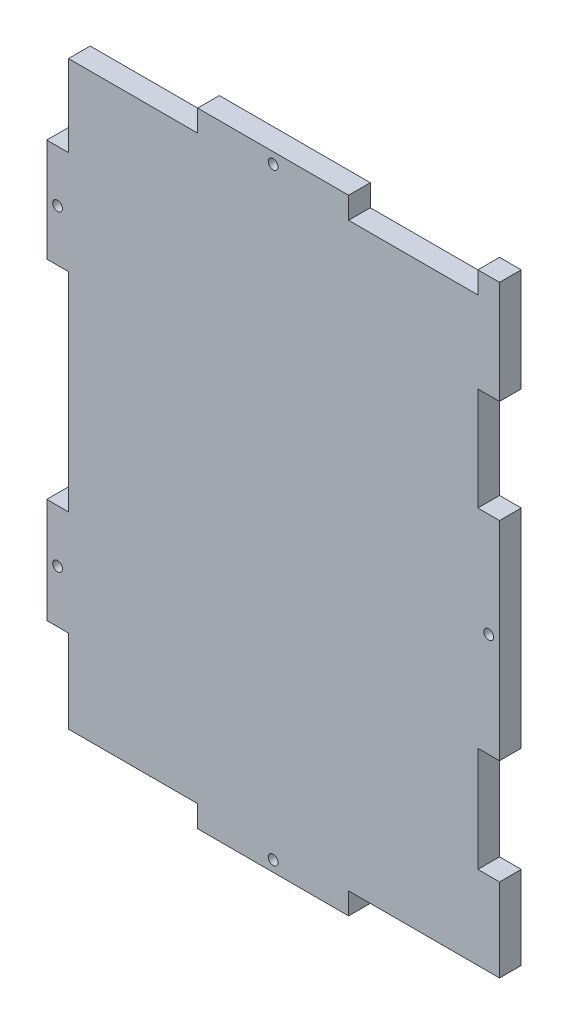
ISO-10303-21;
HEADER;
FILE_DESCRIPTION(('STEP AP214'),'2;1');
FILE_NAME('part.step','',(''),(''),'','','');
FILE_SCHEMA(('AUTOMOTIVE_DESIGN { 1 0 10303 214 1 1 1 1 }'));
ENDSEC;
DATA;
#1=APPLICATION_CONTEXT('core data for automotive mechanical design processes');
#2=APPLICATION_PROTOCOL_DEFINITION('international standard','automotive_design',2000,#1);
#3=PRODUCT_CONTEXT('',#1,'mechanical');
#4=PRODUCT('Part','Part','',(#3));
#5=PRODUCT_RELATED_PRODUCT_CATEGORY('part','',(#4));
#6=PRODUCT_DEFINITION_FORMATION('','',#4);
#7=PRODUCT_DEFINITION_CONTEXT('part definition',#1,'design');
#8=PRODUCT_DEFINITION('design','',#6,#7);
#9=PRODUCT_DEFINITION_SHAPE('','',#8);
#10=(LENGTH_UNIT() NAMED_UNIT(*) SI_UNIT(.MILLI.,.METRE.));
#11=(NAMED_UNIT(*) PLANE_ANGLE_UNIT() SI_UNIT($,.RADIAN.));
#12=(NAMED_UNIT(*) SI_UNIT($,.STERADIAN.) SOLID_ANGLE_UNIT());
#13=UNCERTAINTY_MEASURE_WITH_UNIT(LENGTH_MEASURE(1.E-05),#10,'distance_accuracy_value','');
#14=(GEOMETRIC_REPRESENTATION_CONTEXT(3) GLOBAL_UNCERTAINTY_ASSIGNED_CONTEXT((#13)) GLOBAL_UNIT_ASSIGNED_CONTEXT((#10,
#11,#12)) REPRESENTATION_CONTEXT('',''));
#15=CARTESIAN_POINT('',(0.,0.,0.));
#16=DIRECTION('',(0.,0.,1.));
#17=DIRECTION('',(1.,0.,0.));
#18=AXIS2_PLACEMENT_3D('',#15,#16,#17);
#19=CARTESIAN_POINT('',(60.4012,83.2612,5.7912));
#20=DIRECTION('',(-1.,0.,0.));
#21=DIRECTION('',(0.,-1.,0.));
#22=AXIS2_PLACEMENT_3D('',#19,#20,#21);
#23=PLANE('',#22);
#24=DIRECTION('',(0.,0.,-1.));
#25=VECTOR('',#24,1.);
#26=CARTESIAN_POINT('',(60.4011999999979,-77.4700000000006,129.9464));
#27=LINE('',#26,#25);
#28=CARTESIAN_POINT('',(60.4011999999976,-77.4700000000007,5.7912));
#29=VERTEX_POINT('',#28);
#30=CARTESIAN_POINT('',(60.4011999999976,-77.4700000000007,-2.08166817117217E-13));
#31=VERTEX_POINT('',#30);
#32=EDGE_CURVE('E345',#29,#31,#27,.T.);
#33=ORIENTED_EDGE('',*,*,#32,.T.);
#34=DIRECTION('',(0.,1.,0.));
#35=VECTOR('',#34,1.);
#36=CARTESIAN_POINT('',(60.4012,83.2612,0.));
#37=LINE('',#36,#35);
#38=CARTESIAN_POINT('',(60.4012,-55.2704,0.));
#39=VERTEX_POINT('',#38);
#40=EDGE_CURVE('E457',#31,#39,#37,.T.);
#41=ORIENTED_EDGE('',*,*,#40,.T.);
#42=DIRECTION('',(0.,0.,1.));
#43=VECTOR('',#42,1.);
#44=CARTESIAN_POINT('',(60.4012,-55.2704,0.));
#45=LINE('',#44,#43);
#46=CARTESIAN_POINT('',(60.4012,-55.2704,5.7912));
#47=VERTEX_POINT('',#46);
#48=EDGE_CURVE('E424',#39,#47,#45,.T.);
#49=ORIENTED_EDGE('',*,*,#48,.T.);
#50=DIRECTION('',(0.,1.,0.));
#51=VECTOR('',#50,1.);
#52=CARTESIAN_POINT('',(60.4012,83.2612,5.7912));
#53=LINE('',#52,#51);
#54=EDGE_CURVE('E445',#29,#47,#53,.T.);
#55=ORIENTED_EDGE('',*,*,#54,.F.);
#56=EDGE_LOOP('',(#33,#41,#49,#55));
#57=FACE_BOUND('',#56,.T.);
#58=ADVANCED_FACE('F35',(#57),#23,.F.);
#59=CARTESIAN_POINT('',(-60.4012,83.2612,5.7912));
#60=DIRECTION('',(0.,-1.,0.));
#61=DIRECTION('',(0.,0.,-1.));
#62=AXIS2_PLACEMENT_3D('',#59,#60,#61);
#63=PLANE('',#62);
#64=DIRECTION('',(0.,0.,1.));
#65=VECTOR('',#64,1.);
#66=CARTESIAN_POINT('',(54.6099999999999,83.2611999999997,1.11022302462516E-13));
#67=LINE('',#66,#65);
#68=CARTESIAN_POINT('',(54.6099999999999,83.2611999999997,1.11022302462516E-13));
#69=VERTEX_POINT('',#68);
#70=CARTESIAN_POINT('',(54.6099999999999,83.2611999999997,5.7912));
#71=VERTEX_POINT('',#70);
#72=EDGE_CURVE('E564',#69,#71,#67,.T.);
#73=ORIENTED_EDGE('',*,*,#72,.T.);
#74=DIRECTION('',(-1.,0.,0.));
#75=VECTOR('',#74,1.);
#76=CARTESIAN_POINT('',(-60.4012,83.2612,5.7912));
#77=LINE('',#76,#75);
#78=CARTESIAN_POINT('',(60.4012,83.2612,5.7912));
#79=VERTEX_POINT('',#78);
#80=EDGE_CURVE('E450',#79,#71,#77,.T.);
#81=ORIENTED_EDGE('',*,*,#80,.F.);
#82=DIRECTION('',(0.,0.,-1.));
#83=VECTOR('',#82,1.);
#84=CARTESIAN_POINT('',(60.4012,83.2612,5.7912));
#85=LINE('',#84,#83);
#86=CARTESIAN_POINT('',(60.4012,83.2612,0.));
#87=VERTEX_POINT('',#86);
#88=EDGE_CURVE('E11',#79,#87,#85,.T.);
#89=ORIENTED_EDGE('',*,*,#88,.T.);
#90=DIRECTION('',(-1.,0.,0.));
#91=VECTOR('',#90,1.);
#92=CARTESIAN_POINT('',(-60.4012,83.2612,0.));
#93=LINE('',#92,#91);
#94=EDGE_CURVE('E461',#87,#69,#93,.T.);
#95=ORIENTED_EDGE('',*,*,#94,.T.);
#96=EDGE_LOOP('',(#73,#81,#89,#95));
#97=FACE_BOUND('',#96,.T.);
#98=ADVANCED_FACE('F553',(#97),#63,.F.);
#99=DIRECTION('',(0.,0.,-1.));
#100=VECTOR('',#99,1.);
#101=CARTESIAN_POINT('',(20.1337333333332,83.2611999999998,1.87350135405495E-13));
#102=LINE('',#101,#100);
#103=CARTESIAN_POINT('',(20.1337333333332,83.2611999999998,5.79120000000018));
#104=VERTEX_POINT('',#103);
#105=CARTESIAN_POINT('',(20.1337333333332,83.2611999999998,1.87350135405495E-13));
#106=VERTEX_POINT('',#105);
#107=EDGE_CURVE('E254',#104,#106,#102,.T.);
#108=ORIENTED_EDGE('',*,*,#107,.T.);
#109=CARTESIAN_POINT('',(-20.1337333333335,83.2612,0.));
#110=VERTEX_POINT('',#109);
#111=EDGE_CURVE('E459',#106,#110,#93,.T.);
#112=ORIENTED_EDGE('',*,*,#111,.T.);
#113=DIRECTION('',(0.,0.,1.));
#114=VECTOR('',#113,1.);
#115=CARTESIAN_POINT('',(-20.1337333333335,83.2611999999998,3.12250225675825E-13));
#116=LINE('',#115,#114);
#117=CARTESIAN_POINT('',(-20.1337333333335,83.2611999999998,5.79120000000031));
#118=VERTEX_POINT('',#117);
#119=EDGE_CURVE('E61',#110,#118,#116,.T.);
#120=ORIENTED_EDGE('',*,*,#119,.T.);
#121=EDGE_CURVE('E447',#104,#118,#77,.T.);
#122=ORIENTED_EDGE('',*,*,#121,.F.);
#123=EDGE_LOOP('',(#108,#112,#120,#122));
#124=FACE_BOUND('',#123,.T.);
#125=ADVANCED_FACE('F551',(#124),#63,.F.);
#126=CARTESIAN_POINT('',(-60.4012,83.2612,5.7912));
#127=DIRECTION('',(1.,0.,0.));
#128=DIRECTION('',(0.,1.,0.));
#129=AXIS2_PLACEMENT_3D('',#126,#127,#128);
#130=PLANE('',#129);
#131=DIRECTION('',(0.,0.,-1.));
#132=VECTOR('',#131,1.);
#133=CARTESIAN_POINT('',(-60.4012000000002,-55.2704,4.30211422042248E-13));
#134=LINE('',#133,#132);
#135=CARTESIAN_POINT('',(-60.4012000000001,-55.2704,5.79120000000041));
#136=VERTEX_POINT('',#135);
#137=CARTESIAN_POINT('',(-60.4012,-55.2704,0.));
#138=VERTEX_POINT('',#137);
#139=EDGE_CURVE('E297',#136,#138,#134,.T.);
#140=ORIENTED_EDGE('',*,*,#139,.F.);
#141=DIRECTION('',(0.,-1.,0.));
#142=VECTOR('',#141,1.);
#143=CARTESIAN_POINT('',(-60.4012,83.2612,5.7912));
#144=LINE('',#143,#142);
#145=CARTESIAN_POINT('',(-60.4012000000001,-27.2796,5.79120000000041));
#146=VERTEX_POINT('',#145);
#147=EDGE_CURVE('E453',#146,#136,#144,.T.);
#148=ORIENTED_EDGE('',*,*,#147,.F.);
#149=DIRECTION('',(0.,0.,1.));
#150=VECTOR('',#149,1.);
#151=CARTESIAN_POINT('',(-60.4012000000001,-27.2796,4.16333634234434E-13));
#152=LINE('',#151,#150);
#153=CARTESIAN_POINT('',(-60.4012000000001,-27.2796,4.16333634234434E-13));
#154=VERTEX_POINT('',#153);
#155=EDGE_CURVE('E295',#154,#146,#152,.T.);
#156=ORIENTED_EDGE('',*,*,#155,.F.);
#157=DIRECTION('',(0.,-1.,0.));
#158=VECTOR('',#157,1.);
#159=CARTESIAN_POINT('',(-60.4012,83.2612,0.));
#160=LINE('',#159,#158);
#161=EDGE_CURVE('E464',#154,#138,#160,.T.);
#162=ORIENTED_EDGE('',*,*,#161,.T.);
#163=EDGE_LOOP('',(#140,#148,#156,#162));
#164=FACE_BOUND('',#163,.T.);
#165=ADVANCED_FACE('F549',(#164),#130,.F.);
#166=DIRECTION('',(0.,0.,-1.));
#167=VECTOR('',#166,1.);
#168=CARTESIAN_POINT('',(-60.4012,28.2278666666667,4.30211422042248E-13));
#169=LINE('',#168,#167);
#170=CARTESIAN_POINT('',(-60.4012,28.2278666666667,5.79120000000042));
#171=VERTEX_POINT('',#170);
#172=CARTESIAN_POINT('',(-60.4012,28.2278666666667,0.));
#173=VERTEX_POINT('',#172);
#174=EDGE_CURVE('E278',#171,#173,#169,.T.);
#175=ORIENTED_EDGE('',*,*,#174,.F.);
#176=CARTESIAN_POINT('',(-60.4011999999999,55.7445333333333,5.79120000000043));
#177=VERTEX_POINT('',#176);
#178=EDGE_CURVE('E455',#177,#171,#144,.T.);
#179=ORIENTED_EDGE('',*,*,#178,.F.);
#180=DIRECTION('',(0.,0.,1.));
#181=VECTOR('',#180,1.);
#182=CARTESIAN_POINT('',(-60.4011999999999,55.7445333333333,4.30211422042248E-13));
#183=LINE('',#182,#181);
#184=CARTESIAN_POINT('',(-60.4011999999999,55.7445333333333,4.30211422042248E-13));
#185=VERTEX_POINT('',#184);
#186=EDGE_CURVE('E276',#185,#177,#183,.T.);
#187=ORIENTED_EDGE('',*,*,#186,.F.);
#188=EDGE_CURVE('E467',#185,#173,#160,.T.);
#189=ORIENTED_EDGE('',*,*,#188,.T.);
#190=EDGE_LOOP('',(#175,#179,#187,#189));
#191=FACE_BOUND('',#190,.T.);
#192=ADVANCED_FACE('F547',(#191),#130,.F.);
#193=CARTESIAN_POINT('',(-60.4012,-83.2612,5.7912));
#194=DIRECTION('',(0.,1.,0.));
#195=DIRECTION('',(0.,0.,1.));
#196=AXIS2_PLACEMENT_3D('',#193,#194,#195);
#197=PLANE('',#196);
#198=DIRECTION('',(0.,0.,-1.));
#199=VECTOR('',#198,1.);
#200=CARTESIAN_POINT('',(-20.1337333333357,-83.2612000000009,0.));
#201=LINE('',#200,#199);
#202=CARTESIAN_POINT('',(-20.1337333333357,-83.2612000000009,5.79119999999998));
#203=VERTEX_POINT('',#202);
#204=CARTESIAN_POINT('',(-20.1337333333357,-83.2612000000009,0.));
#205=VERTEX_POINT('',#204);
#206=EDGE_CURVE('E325',#203,#205,#201,.T.);
#207=ORIENTED_EDGE('',*,*,#206,.T.);
#208=DIRECTION('',(1.,0.,0.));
#209=VECTOR('',#208,1.);
#210=CARTESIAN_POINT('',(-60.4012,-83.2612,0.));
#211=LINE('',#210,#209);
#212=CARTESIAN_POINT('',(20.1337333333309,-83.2612,0.));
#213=VERTEX_POINT('',#212);
#214=EDGE_CURVE('E468',#205,#213,#211,.T.);
#215=ORIENTED_EDGE('',*,*,#214,.T.);
#216=DIRECTION('',(0.,0.,1.));
#217=VECTOR('',#216,1.);
#218=CARTESIAN_POINT('',(20.1337333333309,-83.2612000000008,0.));
#219=LINE('',#218,#217);
#220=CARTESIAN_POINT('',(20.1337333333309,-83.2612000000008,5.79119999999989));
#221=VERTEX_POINT('',#220);
#222=EDGE_CURVE('E320',#213,#221,#219,.T.);
#223=ORIENTED_EDGE('',*,*,#222,.T.);
#224=DIRECTION('',(1.,0.,0.));
#225=VECTOR('',#224,1.);
#226=CARTESIAN_POINT('',(-60.4012,-83.2612,5.7912));
#227=LINE('',#226,#225);
#228=EDGE_CURVE('E45',#203,#221,#227,.T.);
#229=ORIENTED_EDGE('',*,*,#228,.F.);
#230=EDGE_LOOP('',(#207,#215,#223,#229));
#231=FACE_BOUND('',#230,.T.);
#232=ADVANCED_FACE('F532',(#231),#197,.F.);
#233=CARTESIAN_POINT('',(0.,0.,5.7912));
#234=DIRECTION('',(0.,0.,1.));
#235=DIRECTION('',(1.,0.,0.));
#236=AXIS2_PLACEMENT_3D('',#233,#234,#235);
#237=PLANE('',#236);
#238=DIRECTION('',(0.,-1.,0.));
#239=VECTOR('',#238,1.);
#240=CARTESIAN_POINT('',(20.1337333333309,-77.4700000000008,5.79119999999989));
#241=LINE('',#240,#239);
#242=CARTESIAN_POINT('',(20.1337333333309,-77.4700000000008,5.79119999999989));
#243=VERTEX_POINT('',#242);
#244=EDGE_CURVE('E338',#243,#221,#241,.T.);
#245=ORIENTED_EDGE('',*,*,#244,.F.);
#246=DIRECTION('',(1.,0.,0.));
#247=VECTOR('',#246,1.);
#248=CARTESIAN_POINT('',(2.28998903173408E-13,-77.4700000000008,5.7912));
#249=LINE('',#248,#247);
#250=EDGE_CURVE('E358',#243,#29,#249,.T.);
#251=ORIENTED_EDGE('',*,*,#250,.T.);
#252=ORIENTED_EDGE('',*,*,#54,.T.);
#253=DIRECTION('',(1.,0.,0.));
#254=VECTOR('',#253,1.);
#255=CARTESIAN_POINT('',(60.4012,-55.2704,5.7912));
#256=LINE('',#255,#254);
#257=CARTESIAN_POINT('',(54.61,-55.2704,5.7912));
#258=VERTEX_POINT('',#257);
#259=EDGE_CURVE('E410',#258,#47,#256,.T.);
#260=ORIENTED_EDGE('',*,*,#259,.F.);
#261=DIRECTION('',(0.,-1.,0.));
#262=VECTOR('',#261,1.);
#263=CARTESIAN_POINT('',(54.61,-27.2796,5.7912));
#264=LINE('',#263,#262);
#265=CARTESIAN_POINT('',(54.61,-27.2796,5.7912));
#266=VERTEX_POINT('',#265);
#267=EDGE_CURVE('E419',#266,#258,#264,.T.);
#268=ORIENTED_EDGE('',*,*,#267,.F.);
#269=DIRECTION('',(-1.,0.,0.));
#270=VECTOR('',#269,1.);
#271=CARTESIAN_POINT('',(60.4012,-27.2796,5.7912));
#272=LINE('',#271,#270);
#273=CARTESIAN_POINT('',(60.4012,-27.2796,5.7912));
#274=VERTEX_POINT('',#273);
#275=EDGE_CURVE('E400',#274,#266,#272,.T.);
#276=ORIENTED_EDGE('',*,*,#275,.F.);
#277=CARTESIAN_POINT('',(60.4012,28.2278666666667,5.7912));
#278=VERTEX_POINT('',#277);
#279=EDGE_CURVE('E448',#274,#278,#53,.T.);
#280=ORIENTED_EDGE('',*,*,#279,.T.);
#281=DIRECTION('',(1.,0.,0.));
#282=VECTOR('',#281,1.);
#283=CARTESIAN_POINT('',(60.4012,28.2278666666667,5.7912));
#284=LINE('',#283,#282);
#285=CARTESIAN_POINT('',(54.61,28.2278666666667,5.7912));
#286=VERTEX_POINT('',#285);
#287=EDGE_CURVE('E384',#286,#278,#284,.T.);
#288=ORIENTED_EDGE('',*,*,#287,.F.);
#289=DIRECTION('',(0.,-1.,0.));
#290=VECTOR('',#289,1.);
#291=CARTESIAN_POINT('',(54.61,55.7445333333333,5.7912));
#292=LINE('',#291,#290);
#293=CARTESIAN_POINT('',(54.61,55.7445333333333,5.7912));
#294=VERTEX_POINT('',#293);
#295=EDGE_CURVE('E393',#294,#286,#292,.T.);
#296=ORIENTED_EDGE('',*,*,#295,.F.);
#297=DIRECTION('',(-1.,0.,0.));
#298=VECTOR('',#297,1.);
#299=CARTESIAN_POINT('',(60.4012,55.7445333333333,5.7912));
#300=LINE('',#299,#298);
#301=CARTESIAN_POINT('',(60.4012,55.7445333333333,5.7912));
#302=VERTEX_POINT('',#301);
#303=EDGE_CURVE('E377',#302,#294,#300,.T.);
#304=ORIENTED_EDGE('',*,*,#303,.F.);
#305=EDGE_CURVE('E449',#302,#79,#53,.T.);
#306=ORIENTED_EDGE('',*,*,#305,.T.);
#307=ORIENTED_EDGE('',*,*,#80,.T.);
#308=DIRECTION('',(0.,-1.,0.));
#309=VECTOR('',#308,1.);
#310=CARTESIAN_POINT('',(54.6099999999997,-1.12732566337481E-13,5.7912));
#311=LINE('',#310,#309);
#312=CARTESIAN_POINT('',(54.6099999999999,77.4699999999996,5.7912));
#313=VERTEX_POINT('',#312);
#314=EDGE_CURVE('E348',#71,#313,#311,.T.);
#315=ORIENTED_EDGE('',*,*,#314,.T.);
#316=DIRECTION('',(-1.,0.,0.));
#317=VECTOR('',#316,1.);
#318=CARTESIAN_POINT('',(1.69330174881743E-13,77.4699999999998,5.7912));
#319=LINE('',#318,#317);
#320=CARTESIAN_POINT('',(20.1337333333332,77.4699999999997,5.79120000000018));
#321=VERTEX_POINT('',#320);
#322=EDGE_CURVE('E352',#313,#321,#319,.T.);
#323=ORIENTED_EDGE('',*,*,#322,.T.);
#324=DIRECTION('',(0.,1.,0.));
#325=VECTOR('',#324,1.);
#326=CARTESIAN_POINT('',(20.1337333333332,77.4699999999997,5.79120000000018));
#327=LINE('',#326,#325);
#328=EDGE_CURVE('E597',#321,#104,#327,.T.);
#329=ORIENTED_EDGE('',*,*,#328,.T.);
#330=ORIENTED_EDGE('',*,*,#121,.T.);
#331=DIRECTION('',(0.,1.,0.));
#332=VECTOR('',#331,1.);
#333=CARTESIAN_POINT('',(-20.1337333333335,77.4699999999998,5.79120000000031));
#334=LINE('',#333,#332);
#335=CARTESIAN_POINT('',(-20.1337333333335,77.4699999999998,5.79120000000031));
#336=VERTEX_POINT('',#335);
#337=EDGE_CURVE('E261',#336,#118,#334,.T.);
#338=ORIENTED_EDGE('',*,*,#337,.F.);
#339=CARTESIAN_POINT('',(-54.6099999999999,77.47,5.7912));
#340=VERTEX_POINT('',#339);
#341=EDGE_CURVE('E251',#336,#340,#319,.T.);
#342=ORIENTED_EDGE('',*,*,#341,.T.);
#343=DIRECTION('',(0.,-1.,0.));
#344=VECTOR('',#343,1.);
#345=CARTESIAN_POINT('',(-54.61,1.01175109956664E-13,5.7912));
#346=LINE('',#345,#344);
#347=CARTESIAN_POINT('',(-54.6099999999999,55.7445333333333,5.79120000000041));
#348=VERTEX_POINT('',#347);
#349=EDGE_CURVE('E357',#340,#348,#346,.T.);
#350=ORIENTED_EDGE('',*,*,#349,.T.);
#351=DIRECTION('',(1.,0.,0.));
#352=VECTOR('',#351,1.);
#353=CARTESIAN_POINT('',(-60.4011999999999,55.7445333333333,5.79120000000043));
#354=LINE('',#353,#352);
#355=EDGE_CURVE('E292',#177,#348,#354,.T.);
#356=ORIENTED_EDGE('',*,*,#355,.F.);
#357=ORIENTED_EDGE('',*,*,#178,.T.);
#358=DIRECTION('',(1.,0.,0.));
#359=VECTOR('',#358,1.);
#360=CARTESIAN_POINT('',(-60.4012,28.2278666666667,5.79120000000042));
#361=LINE('',#360,#359);
#362=CARTESIAN_POINT('',(-54.61,28.2278666666667,5.79120000000041));
#363=VERTEX_POINT('',#362);
#364=EDGE_CURVE('E289',#171,#363,#361,.T.);
#365=ORIENTED_EDGE('',*,*,#364,.T.);
#366=CARTESIAN_POINT('',(-54.6100000000001,-27.2796,5.7912000000004));
#367=VERTEX_POINT('',#366);
#368=EDGE_CURVE('E356',#363,#367,#346,.T.);
#369=ORIENTED_EDGE('',*,*,#368,.T.);
#370=DIRECTION('',(1.,0.,0.));
#371=VECTOR('',#370,1.);
#372=CARTESIAN_POINT('',(-60.4012000000001,-27.2796,5.79120000000041));
#373=LINE('',#372,#371);
#374=EDGE_CURVE('E310',#146,#367,#373,.T.);
#375=ORIENTED_EDGE('',*,*,#374,.F.);
#376=ORIENTED_EDGE('',*,*,#147,.T.);
#377=DIRECTION('',(1.,0.,0.));
#378=VECTOR('',#377,1.);
#379=CARTESIAN_POINT('',(-60.4012000000001,-55.2704,5.79120000000041));
#380=LINE('',#379,#378);
#381=CARTESIAN_POINT('',(-54.6100000000001,-55.2704,5.7912000000004));
#382=VERTEX_POINT('',#381);
#383=EDGE_CURVE('E307',#136,#382,#380,.T.);
#384=ORIENTED_EDGE('',*,*,#383,.T.);
#385=CARTESIAN_POINT('',(-54.6100000000004,-77.470000000001,5.7912));
#386=VERTEX_POINT('',#385);
#387=EDGE_CURVE('E353',#382,#386,#346,.T.);
#388=ORIENTED_EDGE('',*,*,#387,.T.);
#389=CARTESIAN_POINT('',(-20.1337333333357,-77.4700000000009,5.79119999999998));
#390=VERTEX_POINT('',#389);
#391=EDGE_CURVE('E361',#386,#390,#249,.T.);
#392=ORIENTED_EDGE('',*,*,#391,.T.);
#393=DIRECTION('',(0.,-1.,0.));
#394=VECTOR('',#393,1.);
#395=CARTESIAN_POINT('',(-20.1337333333357,-77.4700000000009,5.79119999999998));
#396=LINE('',#395,#394);
#397=EDGE_CURVE('E335',#390,#203,#396,.T.);
#398=ORIENTED_EDGE('',*,*,#397,.T.);
#399=ORIENTED_EDGE('',*,*,#228,.T.);
#400=EDGE_LOOP('',(#245,#251,#252,#260,#268,#276,#280,#288,#296,#304,#306,#307,#315,#323,#329,
#330,#338,#342,#350,#356,#357,#365,#369,#375,#376,#384,#388,#392,#398,#399));
#401=FACE_BOUND('',#400,.T.);
#402=CARTESIAN_POINT('',(0.,-80.3656,5.7912));
#403=DIRECTION('',(0.,0.,1.));
#404=DIRECTION('',(1.,0.,0.));
#405=AXIS2_PLACEMENT_3D('',#402,#403,#404);
#406=CIRCLE('',#405,1.30175);
#407=CARTESIAN_POINT('',(1.30175000000001,-80.3656,5.7912));
#408=VERTEX_POINT('',#407);
#409=EDGE_CURVE('E366',#408,#408,#406,.T.);
#410=ORIENTED_EDGE('',*,*,#409,.F.);
#411=EDGE_LOOP('',(#410));
#412=FACE_BOUND('',#411,.T.);
#413=CARTESIAN_POINT('',(-57.5056,41.9862,5.7912));
#414=DIRECTION('',(0.,0.,1.));
#415=DIRECTION('',(1.,0.,0.));
#416=AXIS2_PLACEMENT_3D('',#413,#414,#415);
#417=CIRCLE('',#416,1.30174999999999);
#418=CARTESIAN_POINT('',(-56.20385,41.9862,5.7912));
#419=VERTEX_POINT('',#418);
#420=EDGE_CURVE('E436',#419,#419,#417,.T.);
#421=ORIENTED_EDGE('',*,*,#420,.F.);
#422=EDGE_LOOP('',(#421));
#423=FACE_BOUND('',#422,.T.);
#424=CARTESIAN_POINT('',(-57.5056,-41.275,5.7912));
#425=DIRECTION('',(0.,0.,1.));
#426=DIRECTION('',(1.,0.,0.));
#427=AXIS2_PLACEMENT_3D('',#424,#425,#426);
#428=CIRCLE('',#427,1.30174999999999);
#429=CARTESIAN_POINT('',(-56.20385,-41.275,5.7912));
#430=VERTEX_POINT('',#429);
#431=EDGE_CURVE('E427',#430,#430,#428,.T.);
#432=ORIENTED_EDGE('',*,*,#431,.F.);
#433=EDGE_LOOP('',(#432));
#434=FACE_BOUND('',#433,.T.);
#435=CARTESIAN_POINT('',(0.,80.3656,5.7912));
#436=DIRECTION('',(0.,0.,1.));
#437=DIRECTION('',(0.998750578124623,-0.0499728195695518,0.));
#438=AXIS2_PLACEMENT_3D('',#435,#436,#437);
#439=CIRCLE('',#438,1.30175000000001);
#440=CARTESIAN_POINT('',(1.30012356507373,80.3005478821253,5.7912));
#441=VERTEX_POINT('',#440);
#442=CARTESIAN_POINT('',(1.30012356507373,80.4306521178747,5.7912));
#443=VERTEX_POINT('',#442);
#444=EDGE_CURVE('E365',#441,#443,#439,.T.);
#445=ORIENTED_EDGE('',*,*,#444,.F.);
#446=CARTESIAN_POINT('',(0.,80.3656,5.7912));
#447=DIRECTION('',(0.,0.,1.));
#448=DIRECTION('',(1.,0.,0.));
#449=AXIS2_PLACEMENT_3D('',#446,#447,#448);
#450=CIRCLE('',#449,1.30175000000001);
#451=EDGE_CURVE('E39',#443,#441,#450,.T.);
#452=ORIENTED_EDGE('',*,*,#451,.F.);
#453=EDGE_LOOP('',(#445,#452));
#454=FACE_BOUND('',#453,.T.);
#455=CARTESIAN_POINT('',(57.5056,0.474133333333345,5.7912));
#456=DIRECTION('',(0.,0.,1.));
#457=DIRECTION('',(1.,0.,0.));
#458=AXIS2_PLACEMENT_3D('',#455,#456,#457);
#459=CIRCLE('',#458,1.30174999999999);
#460=CARTESIAN_POINT('',(58.80735,0.474133333333345,5.7912));
#461=VERTEX_POINT('',#460);
#462=EDGE_CURVE('E371',#461,#461,#459,.T.);
#463=ORIENTED_EDGE('',*,*,#462,.F.);
#464=EDGE_LOOP('',(#463));
#465=FACE_BOUND('',#464,.T.);
#466=ADVANCED_FACE('F528',(#401,#412,#423,#434,#454,#465),#237,.T.);
#467=CARTESIAN_POINT('',(0.,0.,0.));
#468=DIRECTION('',(0.,0.,1.));
#469=DIRECTION('',(1.,0.,0.));
#470=AXIS2_PLACEMENT_3D('',#467,#468,#469);
#471=PLANE('',#470);
#472=CARTESIAN_POINT('',(-57.5056,41.9862,0.));
#473=DIRECTION('',(0.,0.,1.));
#474=DIRECTION('',(1.,0.,0.));
#475=AXIS2_PLACEMENT_3D('',#472,#473,#474);
#476=CIRCLE('',#475,1.30174999999999);
#477=CARTESIAN_POINT('',(-56.20385,41.9862,0.));
#478=VERTEX_POINT('',#477);
#479=EDGE_CURVE('E439',#478,#478,#476,.T.);
#480=ORIENTED_EDGE('',*,*,#479,.T.);
#481=EDGE_LOOP('',(#480));
#482=FACE_BOUND('',#481,.T.);
#483=CARTESIAN_POINT('',(-57.5056,-41.275,0.));
#484=DIRECTION('',(0.,0.,1.));
#485=DIRECTION('',(1.,0.,0.));
#486=AXIS2_PLACEMENT_3D('',#483,#484,#485);
#487=CIRCLE('',#486,1.30174999999999);
#488=CARTESIAN_POINT('',(-56.20385,-41.275,0.));
#489=VERTEX_POINT('',#488);
#490=EDGE_CURVE('E433',#489,#489,#487,.T.);
#491=ORIENTED_EDGE('',*,*,#490,.T.);
#492=EDGE_LOOP('',(#491));
#493=FACE_BOUND('',#492,.T.);
#494=CARTESIAN_POINT('',(57.5056,0.474133333333345,0.));
#495=DIRECTION('',(0.,0.,1.));
#496=DIRECTION('',(1.,0.,0.));
#497=AXIS2_PLACEMENT_3D('',#494,#495,#496);
#498=CIRCLE('',#497,1.30174999999999);
#499=CARTESIAN_POINT('',(58.80735,0.474133333333345,0.));
#500=VERTEX_POINT('',#499);
#501=EDGE_CURVE('E374',#500,#500,#498,.T.);
#502=ORIENTED_EDGE('',*,*,#501,.T.);
#503=EDGE_LOOP('',(#502));
#504=FACE_BOUND('',#503,.T.);
#505=CARTESIAN_POINT('',(0.,80.3656,0.));
#506=DIRECTION('',(0.,0.,1.));
#507=DIRECTION('',(1.,0.,0.));
#508=AXIS2_PLACEMENT_3D('',#505,#506,#507);
#509=CIRCLE('',#508,1.30175000000001);
#510=CARTESIAN_POINT('',(1.30175000000001,80.3656,0.));
#511=VERTEX_POINT('',#510);
#512=EDGE_CURVE('E369',#511,#511,#509,.T.);
#513=ORIENTED_EDGE('',*,*,#512,.T.);
#514=EDGE_LOOP('',(#513));
#515=FACE_BOUND('',#514,.T.);
#516=CARTESIAN_POINT('',(0.,-80.3656,0.));
#517=DIRECTION('',(0.,0.,1.));
#518=DIRECTION('',(1.,0.,0.));
#519=AXIS2_PLACEMENT_3D('',#516,#517,#518);
#520=CIRCLE('',#519,1.30175);
#521=CARTESIAN_POINT('',(1.30175000000001,-80.3656,0.));
#522=VERTEX_POINT('',#521);
#523=EDGE_CURVE('E362',#522,#522,#520,.T.);
#524=ORIENTED_EDGE('',*,*,#523,.T.);
#525=EDGE_LOOP('',(#524));
#526=FACE_BOUND('',#525,.T.);
#527=DIRECTION('',(-1.,0.,0.));
#528=VECTOR('',#527,1.);
#529=CARTESIAN_POINT('',(60.4011999999976,-77.4700000000007,-2.08166817117217E-13));
#530=LINE('',#529,#528);
#531=CARTESIAN_POINT('',(20.1337333333309,-77.4700000000008,0.));
#532=VERTEX_POINT('',#531);
#533=EDGE_CURVE('E343',#31,#532,#530,.T.);
#534=ORIENTED_EDGE('',*,*,#533,.T.);
#535=DIRECTION('',(0.,-1.,0.));
#536=VECTOR('',#535,1.);
#537=CARTESIAN_POINT('',(20.1337333333309,-77.4700000000008,0.));
#538=LINE('',#537,#536);
#539=EDGE_CURVE('E327',#532,#213,#538,.T.);
#540=ORIENTED_EDGE('',*,*,#539,.T.);
#541=ORIENTED_EDGE('',*,*,#214,.F.);
#542=DIRECTION('',(0.,-1.,0.));
#543=VECTOR('',#542,1.);
#544=CARTESIAN_POINT('',(-20.1337333333358,-77.4700000000009,0.));
#545=LINE('',#544,#543);
#546=CARTESIAN_POINT('',(-20.1337333333358,-77.4700000000009,0.));
#547=VERTEX_POINT('',#546);
#548=EDGE_CURVE('E332',#547,#205,#545,.T.);
#549=ORIENTED_EDGE('',*,*,#548,.F.);
#550=CARTESIAN_POINT('',(-54.6100000000004,-77.470000000001,-1.33226762955019E-12));
#551=VERTEX_POINT('',#550);
#552=EDGE_CURVE('E334',#547,#551,#530,.T.);
#553=ORIENTED_EDGE('',*,*,#552,.T.);
#554=DIRECTION('',(0.,1.,0.));
#555=VECTOR('',#554,1.);
#556=CARTESIAN_POINT('',(-54.6100000000002,-83.2612,4.44089209850063E-13));
#557=LINE('',#556,#555);
#558=CARTESIAN_POINT('',(-54.6100000000001,-55.2704,4.16333634234434E-13));
#559=VERTEX_POINT('',#558);
#560=EDGE_CURVE('E314',#551,#559,#557,.T.);
#561=ORIENTED_EDGE('',*,*,#560,.T.);
#562=DIRECTION('',(1.,0.,0.));
#563=VECTOR('',#562,1.);
#564=CARTESIAN_POINT('',(-60.4012000000002,-55.2704,4.30211422042248E-13));
#565=LINE('',#564,#563);
#566=EDGE_CURVE('E304',#138,#559,#565,.T.);
#567=ORIENTED_EDGE('',*,*,#566,.F.);
#568=ORIENTED_EDGE('',*,*,#161,.F.);
#569=DIRECTION('',(1.,0.,0.));
#570=VECTOR('',#569,1.);
#571=CARTESIAN_POINT('',(-60.4012000000001,-27.2796,4.16333634234434E-13));
#572=LINE('',#571,#570);
#573=CARTESIAN_POINT('',(-54.6100000000001,-27.2796,4.02455846426619E-13));
#574=VERTEX_POINT('',#573);
#575=EDGE_CURVE('E300',#154,#574,#572,.T.);
#576=ORIENTED_EDGE('',*,*,#575,.T.);
#577=CARTESIAN_POINT('',(-54.61,28.2278666666667,4.16333634234434E-13));
#578=VERTEX_POINT('',#577);
#579=EDGE_CURVE('E318',#574,#578,#557,.T.);
#580=ORIENTED_EDGE('',*,*,#579,.T.);
#581=DIRECTION('',(1.,0.,0.));
#582=VECTOR('',#581,1.);
#583=CARTESIAN_POINT('',(-60.4012,28.2278666666667,4.30211422042248E-13));
#584=LINE('',#583,#582);
#585=EDGE_CURVE('E285',#173,#578,#584,.T.);
#586=ORIENTED_EDGE('',*,*,#585,.F.);
#587=ORIENTED_EDGE('',*,*,#188,.F.);
#588=DIRECTION('',(1.,0.,0.));
#589=VECTOR('',#588,1.);
#590=CARTESIAN_POINT('',(-60.4011999999999,55.7445333333333,4.30211422042248E-13));
#591=LINE('',#590,#589);
#592=CARTESIAN_POINT('',(-54.6099999999999,55.7445333333333,4.16333634234434E-13));
#593=VERTEX_POINT('',#592);
#594=EDGE_CURVE('E281',#185,#593,#591,.T.);
#595=ORIENTED_EDGE('',*,*,#594,.T.);
#596=CARTESIAN_POINT('',(-54.6099999999999,77.4699999999999,4.61933957751626E-13));
#597=VERTEX_POINT('',#596);
#598=EDGE_CURVE('E267',#593,#597,#557,.T.);
#599=ORIENTED_EDGE('',*,*,#598,.T.);
#600=DIRECTION('',(1.,0.,0.));
#601=VECTOR('',#600,1.);
#602=CARTESIAN_POINT('',(-60.4012000000002,77.4699999999999,4.57966997657877E-13));
#603=LINE('',#602,#601);
#604=CARTESIAN_POINT('',(-20.1337333333335,77.4699999999998,3.12250225675825E-13));
#605=VERTEX_POINT('',#604);
#606=EDGE_CURVE('E248',#597,#605,#603,.T.);
#607=ORIENTED_EDGE('',*,*,#606,.T.);
#608=DIRECTION('',(0.,1.,0.));
#609=VECTOR('',#608,1.);
#610=CARTESIAN_POINT('',(-20.1337333333335,77.4699999999998,3.12250225675825E-13));
#611=LINE('',#610,#609);
#612=EDGE_CURVE('E256',#605,#110,#611,.T.);
#613=ORIENTED_EDGE('',*,*,#612,.T.);
#614=ORIENTED_EDGE('',*,*,#111,.F.);
#615=DIRECTION('',(0.,1.,0.));
#616=VECTOR('',#615,1.);
#617=CARTESIAN_POINT('',(20.1337333333332,77.4699999999997,1.87350135405495E-13));
#618=LINE('',#617,#616);
#619=CARTESIAN_POINT('',(20.1337333333332,77.4699999999997,0.));
#620=VERTEX_POINT('',#619);
#621=EDGE_CURVE('E571',#620,#106,#618,.T.);
#622=ORIENTED_EDGE('',*,*,#621,.F.);
#623=CARTESIAN_POINT('',(54.6099999999999,77.4699999999996,1.11022302462516E-13));
#624=VERTEX_POINT('',#623);
#625=EDGE_CURVE('E53',#620,#624,#603,.T.);
#626=ORIENTED_EDGE('',*,*,#625,.T.);
#627=DIRECTION('',(0.,1.,0.));
#628=VECTOR('',#627,1.);
#629=CARTESIAN_POINT('',(54.6099999999999,77.4699999999996,1.11022302462516E-13));
#630=LINE('',#629,#628);
#631=EDGE_CURVE('E272',#624,#69,#630,.T.);
#632=ORIENTED_EDGE('',*,*,#631,.T.);
#633=ORIENTED_EDGE('',*,*,#94,.F.);
#634=CARTESIAN_POINT('',(60.4012,55.7445333333333,0.));
#635=VERTEX_POINT('',#634);
#636=EDGE_CURVE('E442',#635,#87,#37,.T.);
#637=ORIENTED_EDGE('',*,*,#636,.F.);
#638=DIRECTION('',(-1.,0.,0.));
#639=VECTOR('',#638,1.);
#640=CARTESIAN_POINT('',(60.4012,55.7445333333333,0.));
#641=LINE('',#640,#639);
#642=CARTESIAN_POINT('',(54.61,55.7445333333333,0.));
#643=VERTEX_POINT('',#642);
#644=EDGE_CURVE('E380',#635,#643,#641,.T.);
#645=ORIENTED_EDGE('',*,*,#644,.T.);
#646=DIRECTION('',(0.,-1.,0.));
#647=VECTOR('',#646,1.);
#648=CARTESIAN_POINT('',(54.61,55.7445333333333,0.));
#649=LINE('',#648,#647);
#650=CARTESIAN_POINT('',(54.61,28.2278666666667,0.));
#651=VERTEX_POINT('',#650);
#652=EDGE_CURVE('E383',#643,#651,#649,.T.);
#653=ORIENTED_EDGE('',*,*,#652,.T.);
#654=DIRECTION('',(1.,0.,0.));
#655=VECTOR('',#654,1.);
#656=CARTESIAN_POINT('',(60.4012,28.2278666666667,0.));
#657=LINE('',#656,#655);
#658=CARTESIAN_POINT('',(60.4012,28.2278666666667,0.));
#659=VERTEX_POINT('',#658);
#660=EDGE_CURVE('E387',#651,#659,#657,.T.);
#661=ORIENTED_EDGE('',*,*,#660,.T.);
#662=CARTESIAN_POINT('',(60.4012,-27.2796,0.));
#663=VERTEX_POINT('',#662);
#664=EDGE_CURVE('E460',#663,#659,#37,.T.);
#665=ORIENTED_EDGE('',*,*,#664,.F.);
#666=DIRECTION('',(-1.,0.,0.));
#667=VECTOR('',#666,1.);
#668=CARTESIAN_POINT('',(60.4012,-27.2796,0.));
#669=LINE('',#668,#667);
#670=CARTESIAN_POINT('',(54.61,-27.2796,0.));
#671=VERTEX_POINT('',#670);
#672=EDGE_CURVE('E406',#663,#671,#669,.T.);
#673=ORIENTED_EDGE('',*,*,#672,.T.);
#674=DIRECTION('',(0.,-1.,0.));
#675=VECTOR('',#674,1.);
#676=CARTESIAN_POINT('',(54.61,-27.2796,0.));
#677=LINE('',#676,#675);
#678=CARTESIAN_POINT('',(54.61,-55.2704,0.));
#679=VERTEX_POINT('',#678);
#680=EDGE_CURVE('E409',#671,#679,#677,.T.);
#681=ORIENTED_EDGE('',*,*,#680,.T.);
#682=DIRECTION('',(1.,0.,0.));
#683=VECTOR('',#682,1.);
#684=CARTESIAN_POINT('',(60.4012,-55.2704,0.));
#685=LINE('',#684,#683);
#686=EDGE_CURVE('E413',#679,#39,#685,.T.);
#687=ORIENTED_EDGE('',*,*,#686,.T.);
#688=ORIENTED_EDGE('',*,*,#40,.F.);
#689=EDGE_LOOP('',(#534,#540,#541,#549,#553,#561,#567,#568,#576,#580,#586,#587,#595,#599,#607,
#613,#614,#622,#626,#632,#633,#637,#645,#653,#661,#665,#673,#681,#687,#688));
#690=FACE_BOUND('',#689,.T.);
#691=ADVANCED_FACE('F264',(#482,#493,#504,#515,#526,#690),#471,.F.);
#692=ORIENTED_EDGE('',*,*,#664,.T.);
#693=DIRECTION('',(0.,0.,1.));
#694=VECTOR('',#693,1.);
#695=CARTESIAN_POINT('',(60.4012,28.2278666666667,0.));
#696=LINE('',#695,#694);
#697=EDGE_CURVE('E397',#659,#278,#696,.T.);
#698=ORIENTED_EDGE('',*,*,#697,.T.);
#699=ORIENTED_EDGE('',*,*,#279,.F.);
#700=DIRECTION('',(0.,0.,1.));
#701=VECTOR('',#700,1.);
#702=CARTESIAN_POINT('',(60.4012,-27.2796,0.));
#703=LINE('',#702,#701);
#704=EDGE_CURVE('E416',#663,#274,#703,.T.);
#705=ORIENTED_EDGE('',*,*,#704,.F.);
#706=EDGE_LOOP('',(#692,#698,#699,#705));
#707=FACE_BOUND('',#706,.T.);
#708=ADVANCED_FACE('F543',(#707),#23,.F.);
#709=ORIENTED_EDGE('',*,*,#305,.F.);
#710=DIRECTION('',(0.,0.,1.));
#711=VECTOR('',#710,1.);
#712=CARTESIAN_POINT('',(60.4012,55.7445333333333,0.));
#713=LINE('',#712,#711);
#714=EDGE_CURVE('E390',#635,#302,#713,.T.);
#715=ORIENTED_EDGE('',*,*,#714,.F.);
#716=ORIENTED_EDGE('',*,*,#636,.T.);
#717=ORIENTED_EDGE('',*,*,#88,.F.);
#718=EDGE_LOOP('',(#709,#715,#716,#717));
#719=FACE_BOUND('',#718,.T.);
#720=ADVANCED_FACE('F37',(#719),#23,.F.);
#721=CARTESIAN_POINT('',(-57.5056,41.9862,0.));
#722=DIRECTION('',(0.,0.,1.));
#723=DIRECTION('',(1.,0.,0.));
#724=AXIS2_PLACEMENT_3D('',#721,#722,#723);
#725=CYLINDRICAL_SURFACE('',#724,1.30174999999999);
#726=ORIENTED_EDGE('',*,*,#479,.F.);
#727=EDGE_LOOP('',(#726));
#728=FACE_BOUND('',#727,.T.);
#729=ORIENTED_EDGE('',*,*,#420,.T.);
#730=EDGE_LOOP('',(#729));
#731=FACE_BOUND('',#730,.T.);
#732=ADVANCED_FACE('F523',(#728,#731),#725,.F.);
#733=CARTESIAN_POINT('',(-57.5056,-41.275,0.));
#734=DIRECTION('',(0.,0.,1.));
#735=DIRECTION('',(1.,0.,0.));
#736=AXIS2_PLACEMENT_3D('',#733,#734,#735);
#737=CYLINDRICAL_SURFACE('',#736,1.30174999999999);
#738=ORIENTED_EDGE('',*,*,#490,.F.);
#739=EDGE_LOOP('',(#738));
#740=FACE_BOUND('',#739,.T.);
#741=ORIENTED_EDGE('',*,*,#431,.T.);
#742=EDGE_LOOP('',(#741));
#743=FACE_BOUND('',#742,.T.);
#744=ADVANCED_FACE('F513',(#740,#743),#737,.F.);
#745=CARTESIAN_POINT('',(60.4012,-55.2704,0.));
#746=DIRECTION('',(0.,-1.,0.));
#747=DIRECTION('',(0.,0.,-1.));
#748=AXIS2_PLACEMENT_3D('',#745,#746,#747);
#749=PLANE('',#748);
#750=ORIENTED_EDGE('',*,*,#259,.T.);
#751=ORIENTED_EDGE('',*,*,#48,.F.);
#752=ORIENTED_EDGE('',*,*,#686,.F.);
#753=DIRECTION('',(0.,0.,1.));
#754=VECTOR('',#753,1.);
#755=CARTESIAN_POINT('',(54.61,-55.2704,0.));
#756=LINE('',#755,#754);
#757=EDGE_CURVE('E428',#679,#258,#756,.T.);
#758=ORIENTED_EDGE('',*,*,#757,.T.);
#759=EDGE_LOOP('',(#750,#751,#752,#758));
#760=FACE_BOUND('',#759,.T.);
#761=ADVANCED_FACE('F509',(#760),#749,.F.);
#762=CARTESIAN_POINT('',(54.61,-27.2796,0.));
#763=DIRECTION('',(-1.,0.,0.));
#764=DIRECTION('',(0.,0.,1.));
#765=AXIS2_PLACEMENT_3D('',#762,#763,#764);
#766=PLANE('',#765);
#767=ORIENTED_EDGE('',*,*,#267,.T.);
#768=ORIENTED_EDGE('',*,*,#757,.F.);
#769=ORIENTED_EDGE('',*,*,#680,.F.);
#770=DIRECTION('',(0.,0.,1.));
#771=VECTOR('',#770,1.);
#772=CARTESIAN_POINT('',(54.61,-27.2796,0.));
#773=LINE('',#772,#771);
#774=EDGE_CURVE('E430',#671,#266,#773,.T.);
#775=ORIENTED_EDGE('',*,*,#774,.T.);
#776=EDGE_LOOP('',(#767,#768,#769,#775));
#777=FACE_BOUND('',#776,.T.);
#778=ADVANCED_FACE('F512',(#777),#766,.F.);
#779=CARTESIAN_POINT('',(60.4012,-27.2796,0.));
#780=DIRECTION('',(0.,1.,0.));
#781=DIRECTION('',(0.,0.,1.));
#782=AXIS2_PLACEMENT_3D('',#779,#780,#781);
#783=PLANE('',#782);
#784=ORIENTED_EDGE('',*,*,#275,.T.);
#785=ORIENTED_EDGE('',*,*,#774,.F.);
#786=ORIENTED_EDGE('',*,*,#672,.F.);
#787=ORIENTED_EDGE('',*,*,#704,.T.);
#788=EDGE_LOOP('',(#784,#785,#786,#787));
#789=FACE_BOUND('',#788,.T.);
#790=ADVANCED_FACE('F501',(#789),#783,.F.);
#791=CARTESIAN_POINT('',(60.4012,28.2278666666667,0.));
#792=DIRECTION('',(0.,-1.,0.));
#793=DIRECTION('',(0.,0.,-1.));
#794=AXIS2_PLACEMENT_3D('',#791,#792,#793);
#795=PLANE('',#794);
#796=ORIENTED_EDGE('',*,*,#287,.T.);
#797=ORIENTED_EDGE('',*,*,#697,.F.);
#798=ORIENTED_EDGE('',*,*,#660,.F.);
#799=DIRECTION('',(0.,0.,1.));
#800=VECTOR('',#799,1.);
#801=CARTESIAN_POINT('',(54.61,28.2278666666667,0.));
#802=LINE('',#801,#800);
#803=EDGE_CURVE('E401',#651,#286,#802,.T.);
#804=ORIENTED_EDGE('',*,*,#803,.T.);
#805=EDGE_LOOP('',(#796,#797,#798,#804));
#806=FACE_BOUND('',#805,.T.);
#807=ADVANCED_FACE('F497',(#806),#795,.F.);
#808=CARTESIAN_POINT('',(54.61,55.7445333333333,0.));
#809=DIRECTION('',(-1.,0.,0.));
#810=DIRECTION('',(0.,-1.,0.));
#811=AXIS2_PLACEMENT_3D('',#808,#809,#810);
#812=PLANE('',#811);
#813=ORIENTED_EDGE('',*,*,#295,.T.);
#814=ORIENTED_EDGE('',*,*,#803,.F.);
#815=ORIENTED_EDGE('',*,*,#652,.F.);
#816=DIRECTION('',(0.,0.,1.));
#817=VECTOR('',#816,1.);
#818=CARTESIAN_POINT('',(54.61,55.7445333333333,0.));
#819=LINE('',#818,#817);
#820=EDGE_CURVE('E403',#643,#294,#819,.T.);
#821=ORIENTED_EDGE('',*,*,#820,.T.);
#822=EDGE_LOOP('',(#813,#814,#815,#821));
#823=FACE_BOUND('',#822,.T.);
#824=ADVANCED_FACE('F500',(#823),#812,.F.);
#825=CARTESIAN_POINT('',(60.4012,55.7445333333333,0.));
#826=DIRECTION('',(0.,1.,0.));
#827=DIRECTION('',(-1.,0.,0.));
#828=AXIS2_PLACEMENT_3D('',#825,#826,#827);
#829=PLANE('',#828);
#830=ORIENTED_EDGE('',*,*,#303,.T.);
#831=ORIENTED_EDGE('',*,*,#820,.F.);
#832=ORIENTED_EDGE('',*,*,#644,.F.);
#833=ORIENTED_EDGE('',*,*,#714,.T.);
#834=EDGE_LOOP('',(#830,#831,#832,#833));
#835=FACE_BOUND('',#834,.T.);
#836=ADVANCED_FACE('F495',(#835),#829,.F.);
#837=CARTESIAN_POINT('',(57.5056,0.474133333333345,0.));
#838=DIRECTION('',(0.,0.,1.));
#839=DIRECTION('',(1.,0.,0.));
#840=AXIS2_PLACEMENT_3D('',#837,#838,#839);
#841=CYLINDRICAL_SURFACE('',#840,1.30174999999999);
#842=ORIENTED_EDGE('',*,*,#501,.F.);
#843=EDGE_LOOP('',(#842));
#844=FACE_BOUND('',#843,.T.);
#845=ORIENTED_EDGE('',*,*,#462,.T.);
#846=EDGE_LOOP('',(#845));
#847=FACE_BOUND('',#846,.T.);
#848=ADVANCED_FACE('F490',(#844,#847),#841,.F.);
#849=CARTESIAN_POINT('',(0.,80.3656,0.));
#850=DIRECTION('',(0.,0.,1.));
#851=DIRECTION('',(1.,0.,0.));
#852=AXIS2_PLACEMENT_3D('',#849,#850,#851);
#853=CYLINDRICAL_SURFACE('',#852,1.30175000000001);
#854=ORIENTED_EDGE('',*,*,#512,.F.);
#855=EDGE_LOOP('',(#854));
#856=FACE_BOUND('',#855,.T.);
#857=ORIENTED_EDGE('',*,*,#451,.T.);
#858=ORIENTED_EDGE('',*,*,#444,.T.);
#859=EDGE_LOOP('',(#857,#858));
#860=FACE_BOUND('',#859,.T.);
#861=ADVANCED_FACE('F479',(#856,#860),#853,.F.);
#862=CARTESIAN_POINT('',(0.,-80.3656,0.));
#863=DIRECTION('',(0.,0.,1.));
#864=DIRECTION('',(1.,0.,0.));
#865=AXIS2_PLACEMENT_3D('',#862,#863,#864);
#866=CYLINDRICAL_SURFACE('',#865,1.30175);
#867=ORIENTED_EDGE('',*,*,#523,.F.);
#868=EDGE_LOOP('',(#867));
#869=FACE_BOUND('',#868,.T.);
#870=ORIENTED_EDGE('',*,*,#409,.T.);
#871=EDGE_LOOP('',(#870));
#872=FACE_BOUND('',#871,.T.);
#873=ADVANCED_FACE('F489',(#869,#872),#866,.F.);
#874=CARTESIAN_POINT('',(-60.4011999999999,55.7445333333333,4.30211422042248E-13));
#875=DIRECTION('',(0.,1.,0.));
#876=DIRECTION('',(0.,0.,1.));
#877=AXIS2_PLACEMENT_3D('',#874,#875,#876);
#878=PLANE('',#877);
#879=DIRECTION('',(0.,0.,1.));
#880=VECTOR('',#879,1.);
#881=CARTESIAN_POINT('',(-54.6099999999999,55.7445333333333,4.16333634234434E-13));
#882=LINE('',#881,#880);
#883=EDGE_CURVE('E270',#593,#348,#882,.T.);
#884=ORIENTED_EDGE('',*,*,#883,.F.);
#885=ORIENTED_EDGE('',*,*,#594,.F.);
#886=ORIENTED_EDGE('',*,*,#186,.T.);
#887=ORIENTED_EDGE('',*,*,#355,.T.);
#888=EDGE_LOOP('',(#884,#885,#886,#887));
#889=FACE_BOUND('',#888,.T.);
#890=ADVANCED_FACE('F633',(#889),#878,.T.);
#891=CARTESIAN_POINT('',(-20.1337333333335,77.4699999999998,3.12250225675825E-13));
#892=DIRECTION('',(-1.,0.,0.));
#893=DIRECTION('',(0.,1.,0.));
#894=AXIS2_PLACEMENT_3D('',#891,#892,#893);
#895=PLANE('',#894);
#896=ORIENTED_EDGE('',*,*,#119,.F.);
#897=ORIENTED_EDGE('',*,*,#612,.F.);
#898=DIRECTION('',(0.,0.,1.));
#899=VECTOR('',#898,1.);
#900=CARTESIAN_POINT('',(-20.1337333333335,77.4699999999998,3.12250225675825E-13));
#901=LINE('',#900,#899);
#902=EDGE_CURVE('E244',#605,#336,#901,.T.);
#903=ORIENTED_EDGE('',*,*,#902,.T.);
#904=ORIENTED_EDGE('',*,*,#337,.T.);
#905=EDGE_LOOP('',(#896,#897,#903,#904));
#906=FACE_BOUND('',#905,.T.);
#907=ADVANCED_FACE('F257',(#906),#895,.T.);
#908=CARTESIAN_POINT('',(0.,77.4699999999998,53.0606000000003));
#909=DIRECTION('',(0.,1.,0.));
#910=DIRECTION('',(0.,0.,1.));
#911=AXIS2_PLACEMENT_3D('',#908,#909,#910);
#912=PLANE('',#911);
#913=ORIENTED_EDGE('',*,*,#902,.F.);
#914=ORIENTED_EDGE('',*,*,#606,.F.);
#915=DIRECTION('',(0.,0.,-1.));
#916=VECTOR('',#915,1.);
#917=CARTESIAN_POINT('',(-54.6099999999998,77.47,35.3737333333338));
#918=LINE('',#917,#916);
#919=EDGE_CURVE('E268',#340,#597,#918,.T.);
#920=ORIENTED_EDGE('',*,*,#919,.F.);
#921=ORIENTED_EDGE('',*,*,#341,.F.);
#922=EDGE_LOOP('',(#913,#914,#920,#921));
#923=FACE_BOUND('',#922,.T.);
#924=ADVANCED_FACE('F245',(#923),#912,.T.);
#925=CARTESIAN_POINT('',(-54.61,-41.275,64.9732000000004));
#926=DIRECTION('',(-1.,0.,0.));
#927=DIRECTION('',(0.,0.,1.));
#928=AXIS2_PLACEMENT_3D('',#925,#926,#927);
#929=PLANE('',#928);
#930=ORIENTED_EDGE('',*,*,#919,.T.);
#931=ORIENTED_EDGE('',*,*,#598,.F.);
#932=ORIENTED_EDGE('',*,*,#883,.T.);
#933=ORIENTED_EDGE('',*,*,#349,.F.);
#934=EDGE_LOOP('',(#930,#931,#932,#933));
#935=FACE_BOUND('',#934,.T.);
#936=ADVANCED_FACE('F623',(#935),#929,.T.);
#937=CARTESIAN_POINT('',(20.1337333333332,77.4699999999997,1.87350135405495E-13));
#938=DIRECTION('',(1.,0.,0.));
#939=DIRECTION('',(0.,-1.,0.));
#940=AXIS2_PLACEMENT_3D('',#937,#938,#939);
#941=PLANE('',#940);
#942=ORIENTED_EDGE('',*,*,#107,.F.);
#943=ORIENTED_EDGE('',*,*,#328,.F.);
#944=DIRECTION('',(0.,0.,-1.));
#945=VECTOR('',#944,1.);
#946=CARTESIAN_POINT('',(20.1337333333332,77.4699999999997,1.87350135405495E-13));
#947=LINE('',#946,#945);
#948=EDGE_CURVE('E253',#321,#620,#947,.T.);
#949=ORIENTED_EDGE('',*,*,#948,.T.);
#950=ORIENTED_EDGE('',*,*,#621,.T.);
#951=EDGE_LOOP('',(#942,#943,#949,#950));
#952=FACE_BOUND('',#951,.T.);
#953=ADVANCED_FACE('F605',(#952),#941,.T.);
#954=CARTESIAN_POINT('',(54.6099999999999,77.4699999999996,1.11022302462516E-13));
#955=DIRECTION('',(-1.,0.,0.));
#956=DIRECTION('',(0.,1.,0.));
#957=AXIS2_PLACEMENT_3D('',#954,#955,#956);
#958=PLANE('',#957);
#959=ORIENTED_EDGE('',*,*,#72,.F.);
#960=ORIENTED_EDGE('',*,*,#631,.F.);
#961=DIRECTION('',(0.,0.,1.));
#962=VECTOR('',#961,1.);
#963=CARTESIAN_POINT('',(54.6099999999999,77.4699999999996,1.11022302462516E-13));
#964=LINE('',#963,#962);
#965=EDGE_CURVE('E570',#624,#313,#964,.T.);
#966=ORIENTED_EDGE('',*,*,#965,.T.);
#967=ORIENTED_EDGE('',*,*,#314,.F.);
#968=EDGE_LOOP('',(#959,#960,#966,#967));
#969=FACE_BOUND('',#968,.T.);
#970=ADVANCED_FACE('F610',(#969),#958,.T.);
#971=ORIENTED_EDGE('',*,*,#965,.F.);
#972=ORIENTED_EDGE('',*,*,#625,.F.);
#973=ORIENTED_EDGE('',*,*,#948,.F.);
#974=ORIENTED_EDGE('',*,*,#322,.F.);
#975=EDGE_LOOP('',(#971,#972,#973,#974));
#976=FACE_BOUND('',#975,.T.);
#977=ADVANCED_FACE('F607',(#976),#912,.T.);
#978=CARTESIAN_POINT('',(-60.4012000000001,-27.2796,4.16333634234434E-13));
#979=DIRECTION('',(0.,1.,0.));
#980=DIRECTION('',(1.,0.,0.));
#981=AXIS2_PLACEMENT_3D('',#978,#979,#980);
#982=PLANE('',#981);
#983=DIRECTION('',(0.,0.,1.));
#984=VECTOR('',#983,1.);
#985=CARTESIAN_POINT('',(-54.6100000000001,-27.2796,4.02455846426619E-13));
#986=LINE('',#985,#984);
#987=EDGE_CURVE('E288',#574,#367,#986,.T.);
#988=ORIENTED_EDGE('',*,*,#987,.F.);
#989=ORIENTED_EDGE('',*,*,#575,.F.);
#990=ORIENTED_EDGE('',*,*,#155,.T.);
#991=ORIENTED_EDGE('',*,*,#374,.T.);
#992=EDGE_LOOP('',(#988,#989,#990,#991));
#993=FACE_BOUND('',#992,.T.);
#994=ADVANCED_FACE('F609',(#993),#982,.T.);
#995=CARTESIAN_POINT('',(-60.4012,28.2278666666667,4.30211422042248E-13));
#996=DIRECTION('',(0.,-1.,0.));
#997=DIRECTION('',(0.,0.,-1.));
#998=AXIS2_PLACEMENT_3D('',#995,#996,#997);
#999=PLANE('',#998);
#1000=DIRECTION('',(0.,0.,-1.));
#1001=VECTOR('',#1000,1.);
#1002=CARTESIAN_POINT('',(-54.61,28.2278666666667,4.16333634234434E-13));
#1003=LINE('',#1002,#1001);
#1004=EDGE_CURVE('E279',#363,#578,#1003,.T.);
#1005=ORIENTED_EDGE('',*,*,#1004,.F.);
#1006=ORIENTED_EDGE('',*,*,#364,.F.);
#1007=ORIENTED_EDGE('',*,*,#174,.T.);
#1008=ORIENTED_EDGE('',*,*,#585,.T.);
#1009=EDGE_LOOP('',(#1005,#1006,#1007,#1008));
#1010=FACE_BOUND('',#1009,.T.);
#1011=ADVANCED_FACE('F617',(#1010),#999,.T.);
#1012=ORIENTED_EDGE('',*,*,#1004,.T.);
#1013=ORIENTED_EDGE('',*,*,#579,.F.);
#1014=ORIENTED_EDGE('',*,*,#987,.T.);
#1015=ORIENTED_EDGE('',*,*,#368,.F.);
#1016=EDGE_LOOP('',(#1012,#1013,#1014,#1015));
#1017=FACE_BOUND('',#1016,.T.);
#1018=ADVANCED_FACE('F631',(#1017),#929,.T.);
#1019=CARTESIAN_POINT('',(-20.1337333333358,-77.4700000000009,0.));
#1020=DIRECTION('',(-1.,0.,0.));
#1021=DIRECTION('',(0.,1.,0.));
#1022=AXIS2_PLACEMENT_3D('',#1019,#1020,#1021);
#1023=PLANE('',#1022);
#1024=ORIENTED_EDGE('',*,*,#206,.F.);
#1025=ORIENTED_EDGE('',*,*,#397,.F.);
#1026=DIRECTION('',(0.,0.,-1.));
#1027=VECTOR('',#1026,1.);
#1028=CARTESIAN_POINT('',(-20.1337333333358,-77.4700000000009,0.));
#1029=LINE('',#1028,#1027);
#1030=EDGE_CURVE('E324',#390,#547,#1029,.T.);
#1031=ORIENTED_EDGE('',*,*,#1030,.T.);
#1032=ORIENTED_EDGE('',*,*,#548,.T.);
#1033=EDGE_LOOP('',(#1024,#1025,#1031,#1032));
#1034=FACE_BOUND('',#1033,.T.);
#1035=ADVANCED_FACE('F673',(#1034),#1023,.T.);
#1036=CARTESIAN_POINT('',(-60.4012000000002,-55.2704,4.30211422042248E-13));
#1037=DIRECTION('',(0.,-1.,0.));
#1038=DIRECTION('',(-1.,0.,0.));
#1039=AXIS2_PLACEMENT_3D('',#1036,#1037,#1038);
#1040=PLANE('',#1039);
#1041=DIRECTION('',(0.,0.,-1.));
#1042=VECTOR('',#1041,1.);
#1043=CARTESIAN_POINT('',(-54.6100000000001,-55.2704,4.16333634234434E-13));
#1044=LINE('',#1043,#1042);
#1045=EDGE_CURVE('E298',#382,#559,#1044,.T.);
#1046=ORIENTED_EDGE('',*,*,#1045,.F.);
#1047=ORIENTED_EDGE('',*,*,#383,.F.);
#1048=ORIENTED_EDGE('',*,*,#139,.T.);
#1049=ORIENTED_EDGE('',*,*,#566,.T.);
#1050=EDGE_LOOP('',(#1046,#1047,#1048,#1049));
#1051=FACE_BOUND('',#1050,.T.);
#1052=ADVANCED_FACE('F680',(#1051),#1040,.T.);
#1053=ORIENTED_EDGE('',*,*,#1045,.T.);
#1054=ORIENTED_EDGE('',*,*,#560,.F.);
#1055=DIRECTION('',(0.,0.,-1.));
#1056=VECTOR('',#1055,1.);
#1057=CARTESIAN_POINT('',(-54.6100000000002,-77.470000000001,64.9732));
#1058=LINE('',#1057,#1056);
#1059=EDGE_CURVE('E317',#386,#551,#1058,.T.);
#1060=ORIENTED_EDGE('',*,*,#1059,.F.);
#1061=ORIENTED_EDGE('',*,*,#387,.F.);
#1062=EDGE_LOOP('',(#1053,#1054,#1060,#1061));
#1063=FACE_BOUND('',#1062,.T.);
#1064=ADVANCED_FACE('F632',(#1063),#929,.T.);
#1065=CARTESIAN_POINT('',(-2.26532023139825E-12,-77.4700000000008,64.9731999999999));
#1066=DIRECTION('',(0.,-1.,0.));
#1067=DIRECTION('',(0.,0.,1.));
#1068=AXIS2_PLACEMENT_3D('',#1065,#1066,#1067);
#1069=PLANE('',#1068);
#1070=ORIENTED_EDGE('',*,*,#1059,.T.);
#1071=ORIENTED_EDGE('',*,*,#552,.F.);
#1072=ORIENTED_EDGE('',*,*,#1030,.F.);
#1073=ORIENTED_EDGE('',*,*,#391,.F.);
#1074=EDGE_LOOP('',(#1070,#1071,#1072,#1073));
#1075=FACE_BOUND('',#1074,.T.);
#1076=ADVANCED_FACE('F699',(#1075),#1069,.T.);
#1077=DIRECTION('',(0.,0.,1.));
#1078=VECTOR('',#1077,1.);
#1079=CARTESIAN_POINT('',(20.1337333333309,-77.4700000000008,0.));
#1080=LINE('',#1079,#1078);
#1081=EDGE_CURVE('E321',#532,#243,#1080,.T.);
#1082=ORIENTED_EDGE('',*,*,#1081,.F.);
#1083=ORIENTED_EDGE('',*,*,#533,.F.);
#1084=ORIENTED_EDGE('',*,*,#32,.F.);
#1085=ORIENTED_EDGE('',*,*,#250,.F.);
#1086=EDGE_LOOP('',(#1082,#1083,#1084,#1085));
#1087=FACE_BOUND('',#1086,.T.);
#1088=ADVANCED_FACE('F706',(#1087),#1069,.T.);
#1089=CARTESIAN_POINT('',(20.1337333333309,-77.4700000000008,0.));
#1090=DIRECTION('',(1.,0.,0.));
#1091=DIRECTION('',(0.,-1.,0.));
#1092=AXIS2_PLACEMENT_3D('',#1089,#1090,#1091);
#1093=PLANE('',#1092);
#1094=ORIENTED_EDGE('',*,*,#222,.F.);
#1095=ORIENTED_EDGE('',*,*,#539,.F.);
#1096=ORIENTED_EDGE('',*,*,#1081,.T.);
#1097=ORIENTED_EDGE('',*,*,#244,.T.);
#1098=EDGE_LOOP('',(#1094,#1095,#1096,#1097));
#1099=FACE_BOUND('',#1098,.T.);
#1100=ADVANCED_FACE('F715',(#1099),#1093,.T.);
#1101=CLOSED_SHELL('',(#58,#98,#125,#165,#192,#232,#466,#691,#708,#720,#732,#744,#761,#778,#790,
#807,#824,#836,#848,#861,#873,#890,#907,#924,#936,#953,#970,#977,#994,#1011,#1018,#1035,#1052,
#1064,#1076,#1088,#1100));
#1102=MANIFOLD_SOLID_BREP('B2',#1101);
#1103=ADVANCED_BREP_SHAPE_REPRESENTATION('',(#18,#1102),#14);
#1104=SHAPE_DEFINITION_REPRESENTATION(#9,#1103);
ENDSEC;
END-ISO-10303-21;
